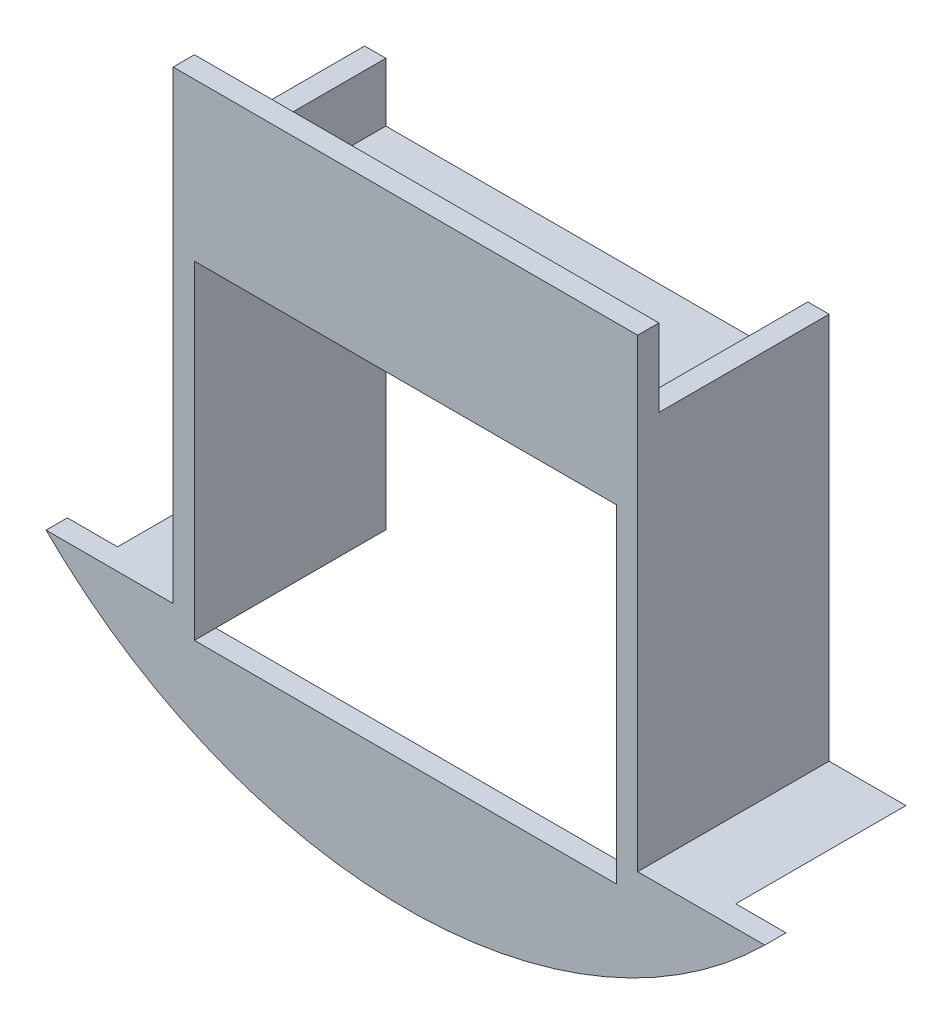
ISO-10303-21;
HEADER;
FILE_DESCRIPTION(('STEP AP214'),'2;1');
FILE_NAME('part.step','',(''),(''),'','','');
FILE_SCHEMA(('AUTOMOTIVE_DESIGN { 1 0 10303 214 1 1 1 1 }'));
ENDSEC;
DATA;
#1=APPLICATION_CONTEXT('core data for automotive mechanical design processes');
#2=APPLICATION_PROTOCOL_DEFINITION('international standard','automotive_design',2000,#1);
#3=PRODUCT_CONTEXT('',#1,'mechanical');
#4=PRODUCT('Part','Part','',(#3));
#5=PRODUCT_RELATED_PRODUCT_CATEGORY('part','',(#4));
#6=PRODUCT_DEFINITION_FORMATION('','',#4);
#7=PRODUCT_DEFINITION_CONTEXT('part definition',#1,'design');
#8=PRODUCT_DEFINITION('design','',#6,#7);
#9=PRODUCT_DEFINITION_SHAPE('','',#8);
#10=(LENGTH_UNIT() NAMED_UNIT(*) SI_UNIT(.MILLI.,.METRE.));
#11=(NAMED_UNIT(*) PLANE_ANGLE_UNIT() SI_UNIT($,.RADIAN.));
#12=(NAMED_UNIT(*) SI_UNIT($,.STERADIAN.) SOLID_ANGLE_UNIT());
#13=UNCERTAINTY_MEASURE_WITH_UNIT(LENGTH_MEASURE(1.E-05),#10,'distance_accuracy_value','');
#14=(GEOMETRIC_REPRESENTATION_CONTEXT(3) GLOBAL_UNCERTAINTY_ASSIGNED_CONTEXT((#13)) GLOBAL_UNIT_ASSIGNED_CONTEXT((#10,
#11,#12)) REPRESENTATION_CONTEXT('',''));
#15=CARTESIAN_POINT('',(0.,0.,0.));
#16=DIRECTION('',(0.,0.,1.));
#17=DIRECTION('',(1.,0.,0.));
#18=AXIS2_PLACEMENT_3D('',#15,#16,#17);
#19=CARTESIAN_POINT('',(34.671,-49.022,25.4));
#20=DIRECTION('',(-1.,0.,0.));
#21=DIRECTION('',(0.,-1.,0.));
#22=AXIS2_PLACEMENT_3D('',#19,#20,#21);
#23=PLANE('',#22);
#24=DIRECTION('',(0.,0.,1.));
#25=VECTOR('',#24,1.);
#26=CARTESIAN_POINT('',(34.671,-45.847,-11.9054431885964));
#27=LINE('',#26,#25);
#28=CARTESIAN_POINT('',(34.671,-45.847,0.));
#29=VERTEX_POINT('',#28);
#30=CARTESIAN_POINT('',(34.671,-45.847,28.575));
#31=VERTEX_POINT('',#30);
#32=EDGE_CURVE('E58',#29,#31,#27,.T.);
#33=ORIENTED_EDGE('',*,*,#32,.F.);
#34=DIRECTION('',(0.,1.,0.));
#35=VECTOR('',#34,1.);
#36=CARTESIAN_POINT('',(34.671,-49.022,0.));
#37=LINE('',#36,#35);
#38=CARTESIAN_POINT('',(34.671,11.938,0.));
#39=VERTEX_POINT('',#38);
#40=EDGE_CURVE('E190',#29,#39,#37,.T.);
#41=ORIENTED_EDGE('',*,*,#40,.T.);
#42=DIRECTION('',(0.,0.,-1.));
#43=VECTOR('',#42,1.);
#44=CARTESIAN_POINT('',(34.671,11.938,25.4));
#45=LINE('',#44,#43);
#46=CARTESIAN_POINT('',(34.671,11.938,25.4));
#47=VERTEX_POINT('',#46);
#48=EDGE_CURVE('E215',#47,#39,#45,.T.);
#49=ORIENTED_EDGE('',*,*,#48,.F.);
#50=DIRECTION('',(0.,1.,0.));
#51=VECTOR('',#50,1.);
#52=CARTESIAN_POINT('',(34.671,-45.847,25.4));
#53=LINE('',#52,#51);
#54=CARTESIAN_POINT('',(34.671,23.5101704078315,25.4));
#55=VERTEX_POINT('',#54);
#56=EDGE_CURVE('E333',#47,#55,#53,.T.);
#57=ORIENTED_EDGE('',*,*,#56,.T.);
#58=DIRECTION('',(0.,0.,-1.));
#59=VECTOR('',#58,1.);
#60=CARTESIAN_POINT('',(34.671,23.5101704078315,28.575));
#61=LINE('',#60,#59);
#62=CARTESIAN_POINT('',(34.671,23.5101704078315,28.575));
#63=VERTEX_POINT('',#62);
#64=EDGE_CURVE('E347',#63,#55,#61,.T.);
#65=ORIENTED_EDGE('',*,*,#64,.F.);
#66=DIRECTION('',(0.,1.,0.));
#67=VECTOR('',#66,1.);
#68=CARTESIAN_POINT('',(34.671,-45.847,28.575));
#69=LINE('',#68,#67);
#70=EDGE_CURVE('E309',#31,#63,#69,.T.);
#71=ORIENTED_EDGE('',*,*,#70,.F.);
#72=EDGE_LOOP('',(#33,#41,#49,#57,#65,#71));
#73=FACE_BOUND('',#72,.T.);
#74=ADVANCED_FACE('F42',(#73),#23,.F.);
#75=CARTESIAN_POINT('',(-34.671,11.938,25.4));
#76=DIRECTION('',(1.,0.,0.));
#77=DIRECTION('',(0.,1.,0.));
#78=AXIS2_PLACEMENT_3D('',#75,#76,#77);
#79=PLANE('',#78);
#80=DIRECTION('',(0.,-1.,0.));
#81=VECTOR('',#80,1.);
#82=CARTESIAN_POINT('',(-34.671,11.938,0.));
#83=LINE('',#82,#81);
#84=CARTESIAN_POINT('',(-34.671,11.938,0.));
#85=VERTEX_POINT('',#84);
#86=CARTESIAN_POINT('',(-34.671,-45.847,0.));
#87=VERTEX_POINT('',#86);
#88=EDGE_CURVE('E169',#85,#87,#83,.T.);
#89=ORIENTED_EDGE('',*,*,#88,.T.);
#90=DIRECTION('',(0.,0.,1.));
#91=VECTOR('',#90,1.);
#92=CARTESIAN_POINT('',(-34.671,-45.847,-11.9054431885964));
#93=LINE('',#92,#91);
#94=CARTESIAN_POINT('',(-34.671,-45.847,28.575));
#95=VERTEX_POINT('',#94);
#96=EDGE_CURVE('E385',#87,#95,#93,.T.);
#97=ORIENTED_EDGE('',*,*,#96,.T.);
#98=DIRECTION('',(0.,-1.,0.));
#99=VECTOR('',#98,1.);
#100=CARTESIAN_POINT('',(-34.671,-45.847,28.575));
#101=LINE('',#100,#99);
#102=CARTESIAN_POINT('',(-34.671,23.5101704078315,28.575));
#103=VERTEX_POINT('',#102);
#104=EDGE_CURVE('E317',#103,#95,#101,.T.);
#105=ORIENTED_EDGE('',*,*,#104,.F.);
#106=DIRECTION('',(0.,0.,-1.));
#107=VECTOR('',#106,1.);
#108=CARTESIAN_POINT('',(-34.671,23.5101704078315,28.575));
#109=LINE('',#108,#107);
#110=CARTESIAN_POINT('',(-34.671,23.5101704078315,25.4));
#111=VERTEX_POINT('',#110);
#112=EDGE_CURVE('E321',#103,#111,#109,.T.);
#113=ORIENTED_EDGE('',*,*,#112,.T.);
#114=DIRECTION('',(0.,-1.,0.));
#115=VECTOR('',#114,1.);
#116=CARTESIAN_POINT('',(-34.671,-45.847,25.4));
#117=LINE('',#116,#115);
#118=CARTESIAN_POINT('',(-34.671,11.938,25.4));
#119=VERTEX_POINT('',#118);
#120=EDGE_CURVE('E301',#111,#119,#117,.T.);
#121=ORIENTED_EDGE('',*,*,#120,.T.);
#122=DIRECTION('',(0.,0.,-1.));
#123=VECTOR('',#122,1.);
#124=CARTESIAN_POINT('',(-34.671,11.938,25.4));
#125=LINE('',#124,#123);
#126=EDGE_CURVE('E168',#119,#85,#125,.T.);
#127=ORIENTED_EDGE('',*,*,#126,.T.);
#128=EDGE_LOOP('',(#89,#97,#105,#113,#121,#127));
#129=FACE_BOUND('',#128,.T.);
#130=ADVANCED_FACE('F44',(#129),#79,.F.);
#131=CARTESIAN_POINT('',(-34.671,-49.022,25.4));
#132=DIRECTION('',(0.,1.,0.));
#133=DIRECTION('',(0.,0.,1.));
#134=AXIS2_PLACEMENT_3D('',#131,#132,#133);
#135=PLANE('',#134);
#136=DIRECTION('',(1.,0.,0.));
#137=VECTOR('',#136,1.);
#138=CARTESIAN_POINT('',(-34.671,-49.022,0.));
#139=LINE('',#138,#137);
#140=CARTESIAN_POINT('',(-42.1386,-49.022,0.));
#141=VERTEX_POINT('',#140);
#142=CARTESIAN_POINT('',(-31.496,-49.022,0.));
#143=VERTEX_POINT('',#142);
#144=EDGE_CURVE('E173',#141,#143,#139,.T.);
#145=ORIENTED_EDGE('',*,*,#144,.T.);
#146=DIRECTION('',(0.,0.,-1.));
#147=VECTOR('',#146,1.);
#148=CARTESIAN_POINT('',(-31.496,-49.022,25.4));
#149=LINE('',#148,#147);
#150=CARTESIAN_POINT('',(-31.496,-49.022,25.4));
#151=VERTEX_POINT('',#150);
#152=EDGE_CURVE('E11',#151,#143,#149,.T.);
#153=ORIENTED_EDGE('',*,*,#152,.F.);
#154=DIRECTION('',(1.,0.,0.));
#155=VECTOR('',#154,1.);
#156=CARTESIAN_POINT('',(-34.671,-49.022,25.4));
#157=LINE('',#156,#155);
#158=CARTESIAN_POINT('',(-42.1386,-49.022,25.4));
#159=VERTEX_POINT('',#158);
#160=EDGE_CURVE('E206',#159,#151,#157,.T.);
#161=ORIENTED_EDGE('',*,*,#160,.F.);
#162=DIRECTION('',(0.,0.,1.));
#163=VECTOR('',#162,1.);
#164=CARTESIAN_POINT('',(-42.1386,-49.022,-11.9054431885964));
#165=LINE('',#164,#163);
#166=EDGE_CURVE('E382',#141,#159,#165,.T.);
#167=ORIENTED_EDGE('',*,*,#166,.F.);
#168=EDGE_LOOP('',(#145,#153,#161,#167));
#169=FACE_BOUND('',#168,.T.);
#170=ADVANCED_FACE('F458',(#169),#135,.F.);
#171=CARTESIAN_POINT('',(-31.496,-49.022,25.4));
#172=DIRECTION('',(-1.,0.,0.));
#173=DIRECTION('',(0.,-1.,0.));
#174=AXIS2_PLACEMENT_3D('',#171,#172,#173);
#175=PLANE('',#174);
#176=DIRECTION('',(0.,1.,0.));
#177=VECTOR('',#176,1.);
#178=CARTESIAN_POINT('',(-31.496,-49.022,0.));
#179=LINE('',#178,#177);
#180=CARTESIAN_POINT('',(-31.496,0.,0.));
#181=VERTEX_POINT('',#180);
#182=EDGE_CURVE('E177',#143,#181,#179,.T.);
#183=ORIENTED_EDGE('',*,*,#182,.T.);
#184=DIRECTION('',(0.,0.,-1.));
#185=VECTOR('',#184,1.);
#186=CARTESIAN_POINT('',(-31.496,0.,25.4));
#187=LINE('',#186,#185);
#188=CARTESIAN_POINT('',(-31.496,0.,28.575));
#189=VERTEX_POINT('',#188);
#190=EDGE_CURVE('E51',#189,#181,#187,.T.);
#191=ORIENTED_EDGE('',*,*,#190,.F.);
#192=DIRECTION('',(0.,-1.,0.));
#193=VECTOR('',#192,1.);
#194=CARTESIAN_POINT('',(-31.496,0.,28.575));
#195=LINE('',#194,#193);
#196=CARTESIAN_POINT('',(-31.496,-49.022,28.575));
#197=VERTEX_POINT('',#196);
#198=EDGE_CURVE('E286',#189,#197,#195,.T.);
#199=ORIENTED_EDGE('',*,*,#198,.T.);
#200=DIRECTION('',(0.,0.,-1.));
#201=VECTOR('',#200,1.);
#202=CARTESIAN_POINT('',(-31.496,-49.022,28.575));
#203=LINE('',#202,#201);
#204=EDGE_CURVE('E280',#197,#151,#203,.T.);
#205=ORIENTED_EDGE('',*,*,#204,.T.);
#206=ORIENTED_EDGE('',*,*,#152,.T.);
#207=EDGE_LOOP('',(#183,#191,#199,#205,#206));
#208=FACE_BOUND('',#207,.T.);
#209=ADVANCED_FACE('F414',(#208),#175,.F.);
#210=CARTESIAN_POINT('',(-31.496,0.,25.4));
#211=DIRECTION('',(0.,1.,0.));
#212=DIRECTION('',(0.,0.,1.));
#213=AXIS2_PLACEMENT_3D('',#210,#211,#212);
#214=PLANE('',#213);
#215=DIRECTION('',(1.,0.,0.));
#216=VECTOR('',#215,1.);
#217=CARTESIAN_POINT('',(-31.496,0.,0.));
#218=LINE('',#217,#216);
#219=CARTESIAN_POINT('',(31.496,0.,0.));
#220=VERTEX_POINT('',#219);
#221=EDGE_CURVE('E180',#181,#220,#218,.T.);
#222=ORIENTED_EDGE('',*,*,#221,.T.);
#223=DIRECTION('',(0.,0.,-1.));
#224=VECTOR('',#223,1.);
#225=CARTESIAN_POINT('',(31.496,0.,25.4));
#226=LINE('',#225,#224);
#227=CARTESIAN_POINT('',(31.496,0.,28.575));
#228=VERTEX_POINT('',#227);
#229=EDGE_CURVE('E223',#228,#220,#226,.T.);
#230=ORIENTED_EDGE('',*,*,#229,.F.);
#231=DIRECTION('',(-1.,0.,0.));
#232=VECTOR('',#231,1.);
#233=CARTESIAN_POINT('',(-31.496,0.,28.575));
#234=LINE('',#233,#232);
#235=EDGE_CURVE('E236',#228,#189,#234,.T.);
#236=ORIENTED_EDGE('',*,*,#235,.T.);
#237=ORIENTED_EDGE('',*,*,#190,.T.);
#238=EDGE_LOOP('',(#222,#230,#236,#237));
#239=FACE_BOUND('',#238,.T.);
#240=ADVANCED_FACE('F232',(#239),#214,.F.);
#241=CARTESIAN_POINT('',(31.496,0.,25.4));
#242=DIRECTION('',(1.,0.,0.));
#243=DIRECTION('',(0.,1.,0.));
#244=AXIS2_PLACEMENT_3D('',#241,#242,#243);
#245=PLANE('',#244);
#246=DIRECTION('',(0.,-1.,0.));
#247=VECTOR('',#246,1.);
#248=CARTESIAN_POINT('',(31.496,0.,0.));
#249=LINE('',#248,#247);
#250=CARTESIAN_POINT('',(31.496,-49.022,0.));
#251=VERTEX_POINT('',#250);
#252=EDGE_CURVE('E183',#220,#251,#249,.T.);
#253=ORIENTED_EDGE('',*,*,#252,.T.);
#254=DIRECTION('',(0.,0.,-1.));
#255=VECTOR('',#254,1.);
#256=CARTESIAN_POINT('',(31.496,-49.022,25.4));
#257=LINE('',#256,#255);
#258=CARTESIAN_POINT('',(31.496,-49.022,25.4));
#259=VERTEX_POINT('',#258);
#260=EDGE_CURVE('E219',#259,#251,#257,.T.);
#261=ORIENTED_EDGE('',*,*,#260,.F.);
#262=DIRECTION('',(0.,0.,-1.));
#263=VECTOR('',#262,1.);
#264=CARTESIAN_POINT('',(31.496,-49.022,28.575));
#265=LINE('',#264,#263);
#266=CARTESIAN_POINT('',(31.496,-49.022,28.575));
#267=VERTEX_POINT('',#266);
#268=EDGE_CURVE('E270',#267,#259,#265,.T.);
#269=ORIENTED_EDGE('',*,*,#268,.F.);
#270=DIRECTION('',(0.,1.,0.));
#271=VECTOR('',#270,1.);
#272=CARTESIAN_POINT('',(31.496,0.,28.575));
#273=LINE('',#272,#271);
#274=EDGE_CURVE('E402',#267,#228,#273,.T.);
#275=ORIENTED_EDGE('',*,*,#274,.T.);
#276=ORIENTED_EDGE('',*,*,#229,.T.);
#277=EDGE_LOOP('',(#253,#261,#269,#275,#276));
#278=FACE_BOUND('',#277,.T.);
#279=ADVANCED_FACE('F249',(#278),#245,.F.);
#280=CARTESIAN_POINT('',(31.496,-49.022,25.4));
#281=DIRECTION('',(0.,1.,0.));
#282=DIRECTION('',(0.,0.,1.));
#283=AXIS2_PLACEMENT_3D('',#280,#281,#282);
#284=PLANE('',#283);
#285=DIRECTION('',(1.,0.,0.));
#286=VECTOR('',#285,1.);
#287=CARTESIAN_POINT('',(31.496,-49.022,0.));
#288=LINE('',#287,#286);
#289=CARTESIAN_POINT('',(42.1386,-49.022,0.));
#290=VERTEX_POINT('',#289);
#291=EDGE_CURVE('E186',#251,#290,#288,.T.);
#292=ORIENTED_EDGE('',*,*,#291,.T.);
#293=DIRECTION('',(0.,0.,1.));
#294=VECTOR('',#293,1.);
#295=CARTESIAN_POINT('',(42.1386,-49.022,-11.9054431885964));
#296=LINE('',#295,#294);
#297=CARTESIAN_POINT('',(42.1386,-49.022,25.4));
#298=VERTEX_POINT('',#297);
#299=EDGE_CURVE('E261',#290,#298,#296,.T.);
#300=ORIENTED_EDGE('',*,*,#299,.T.);
#301=DIRECTION('',(1.,0.,0.));
#302=VECTOR('',#301,1.);
#303=CARTESIAN_POINT('',(31.496,-49.022,25.4));
#304=LINE('',#303,#302);
#305=EDGE_CURVE('E158',#259,#298,#304,.T.);
#306=ORIENTED_EDGE('',*,*,#305,.F.);
#307=ORIENTED_EDGE('',*,*,#260,.T.);
#308=EDGE_LOOP('',(#292,#300,#306,#307));
#309=FACE_BOUND('',#308,.T.);
#310=ADVANCED_FACE('F254',(#309),#284,.F.);
#311=CARTESIAN_POINT('',(34.671,11.938,25.4));
#312=DIRECTION('',(0.,-1.,0.));
#313=DIRECTION('',(0.,0.,-1.));
#314=AXIS2_PLACEMENT_3D('',#311,#312,#313);
#315=PLANE('',#314);
#316=DIRECTION('',(-1.,0.,0.));
#317=VECTOR('',#316,1.);
#318=CARTESIAN_POINT('',(34.671,11.938,0.));
#319=LINE('',#318,#317);
#320=CARTESIAN_POINT('',(31.496,11.938,0.));
#321=VERTEX_POINT('',#320);
#322=EDGE_CURVE('E193',#39,#321,#319,.T.);
#323=ORIENTED_EDGE('',*,*,#322,.T.);
#324=DIRECTION('',(0.,0.,-1.));
#325=VECTOR('',#324,1.);
#326=CARTESIAN_POINT('',(31.496,11.938,25.4));
#327=LINE('',#326,#325);
#328=CARTESIAN_POINT('',(31.496,11.938,25.4));
#329=VERTEX_POINT('',#328);
#330=EDGE_CURVE('E139',#329,#321,#327,.T.);
#331=ORIENTED_EDGE('',*,*,#330,.F.);
#332=DIRECTION('',(-1.,0.,0.));
#333=VECTOR('',#332,1.);
#334=CARTESIAN_POINT('',(34.671,11.938,25.4));
#335=LINE('',#334,#333);
#336=EDGE_CURVE('E154',#47,#329,#335,.T.);
#337=ORIENTED_EDGE('',*,*,#336,.F.);
#338=ORIENTED_EDGE('',*,*,#48,.T.);
#339=EDGE_LOOP('',(#323,#331,#337,#338));
#340=FACE_BOUND('',#339,.T.);
#341=ADVANCED_FACE('F472',(#340),#315,.F.);
#342=CARTESIAN_POINT('',(31.496,11.938,25.4));
#343=DIRECTION('',(1.,0.,0.));
#344=DIRECTION('',(0.,0.,-1.));
#345=AXIS2_PLACEMENT_3D('',#342,#343,#344);
#346=PLANE('',#345);
#347=DIRECTION('',(0.,-1.,0.));
#348=VECTOR('',#347,1.);
#349=CARTESIAN_POINT('',(31.496,11.938,0.));
#350=LINE('',#349,#348);
#351=CARTESIAN_POINT('',(31.496,3.175,0.));
#352=VERTEX_POINT('',#351);
#353=EDGE_CURVE('E135',#321,#352,#350,.T.);
#354=ORIENTED_EDGE('',*,*,#353,.T.);
#355=DIRECTION('',(0.,0.,-1.));
#356=VECTOR('',#355,1.);
#357=CARTESIAN_POINT('',(31.496,3.175,25.4));
#358=LINE('',#357,#356);
#359=CARTESIAN_POINT('',(31.496,3.175,25.4));
#360=VERTEX_POINT('',#359);
#361=EDGE_CURVE('E127',#360,#352,#358,.T.);
#362=ORIENTED_EDGE('',*,*,#361,.F.);
#363=DIRECTION('',(0.,-1.,0.));
#364=VECTOR('',#363,1.);
#365=CARTESIAN_POINT('',(31.496,11.938,25.4));
#366=LINE('',#365,#364);
#367=EDGE_CURVE('E132',#329,#360,#366,.T.);
#368=ORIENTED_EDGE('',*,*,#367,.F.);
#369=ORIENTED_EDGE('',*,*,#330,.T.);
#370=EDGE_LOOP('',(#354,#362,#368,#369));
#371=FACE_BOUND('',#370,.T.);
#372=ADVANCED_FACE('F129',(#371),#346,.F.);
#373=CARTESIAN_POINT('',(31.496,3.175,25.4));
#374=DIRECTION('',(0.,-1.,0.));
#375=DIRECTION('',(0.,0.,-1.));
#376=AXIS2_PLACEMENT_3D('',#373,#374,#375);
#377=PLANE('',#376);
#378=DIRECTION('',(-1.,0.,0.));
#379=VECTOR('',#378,1.);
#380=CARTESIAN_POINT('',(31.496,3.175,0.));
#381=LINE('',#380,#379);
#382=CARTESIAN_POINT('',(-31.496,3.175,0.));
#383=VERTEX_POINT('',#382);
#384=EDGE_CURVE('E198',#352,#383,#381,.T.);
#385=ORIENTED_EDGE('',*,*,#384,.T.);
#386=DIRECTION('',(0.,0.,-1.));
#387=VECTOR('',#386,1.);
#388=CARTESIAN_POINT('',(-31.496,3.175,25.4));
#389=LINE('',#388,#387);
#390=CARTESIAN_POINT('',(-31.496,3.175,25.4));
#391=VERTEX_POINT('',#390);
#392=EDGE_CURVE('E140',#391,#383,#389,.T.);
#393=ORIENTED_EDGE('',*,*,#392,.F.);
#394=DIRECTION('',(-1.,0.,0.));
#395=VECTOR('',#394,1.);
#396=CARTESIAN_POINT('',(31.496,3.175,25.4));
#397=LINE('',#396,#395);
#398=EDGE_CURVE('E143',#360,#391,#397,.T.);
#399=ORIENTED_EDGE('',*,*,#398,.F.);
#400=ORIENTED_EDGE('',*,*,#361,.T.);
#401=EDGE_LOOP('',(#385,#393,#399,#400));
#402=FACE_BOUND('',#401,.T.);
#403=ADVANCED_FACE('F144',(#402),#377,.F.);
#404=CARTESIAN_POINT('',(-31.496,3.175,25.4));
#405=DIRECTION('',(-1.,0.,0.));
#406=DIRECTION('',(0.,0.,1.));
#407=AXIS2_PLACEMENT_3D('',#404,#405,#406);
#408=PLANE('',#407);
#409=DIRECTION('',(0.,1.,0.));
#410=VECTOR('',#409,1.);
#411=CARTESIAN_POINT('',(-31.496,3.175,0.));
#412=LINE('',#411,#410);
#413=CARTESIAN_POINT('',(-31.496,11.938,0.));
#414=VERTEX_POINT('',#413);
#415=EDGE_CURVE('E201',#383,#414,#412,.T.);
#416=ORIENTED_EDGE('',*,*,#415,.T.);
#417=DIRECTION('',(0.,0.,-1.));
#418=VECTOR('',#417,1.);
#419=CARTESIAN_POINT('',(-31.496,11.938,25.4));
#420=LINE('',#419,#418);
#421=CARTESIAN_POINT('',(-31.496,11.938,25.4));
#422=VERTEX_POINT('',#421);
#423=EDGE_CURVE('E67',#422,#414,#420,.T.);
#424=ORIENTED_EDGE('',*,*,#423,.F.);
#425=DIRECTION('',(0.,1.,0.));
#426=VECTOR('',#425,1.);
#427=CARTESIAN_POINT('',(-31.496,3.175,25.4));
#428=LINE('',#427,#426);
#429=EDGE_CURVE('E149',#391,#422,#428,.T.);
#430=ORIENTED_EDGE('',*,*,#429,.F.);
#431=ORIENTED_EDGE('',*,*,#392,.T.);
#432=EDGE_LOOP('',(#416,#424,#430,#431));
#433=FACE_BOUND('',#432,.T.);
#434=ADVANCED_FACE('F508',(#433),#408,.F.);
#435=CARTESIAN_POINT('',(-31.496,11.938,25.4));
#436=DIRECTION('',(0.,-1.,0.));
#437=DIRECTION('',(0.,0.,-1.));
#438=AXIS2_PLACEMENT_3D('',#435,#436,#437);
#439=PLANE('',#438);
#440=DIRECTION('',(-1.,0.,0.));
#441=VECTOR('',#440,1.);
#442=CARTESIAN_POINT('',(-31.496,11.938,0.));
#443=LINE('',#442,#441);
#444=EDGE_CURVE('E105',#414,#85,#443,.T.);
#445=ORIENTED_EDGE('',*,*,#444,.T.);
#446=ORIENTED_EDGE('',*,*,#126,.F.);
#447=DIRECTION('',(-1.,0.,0.));
#448=VECTOR('',#447,1.);
#449=CARTESIAN_POINT('',(-31.496,11.938,25.4));
#450=LINE('',#449,#448);
#451=EDGE_CURVE('E164',#422,#119,#450,.T.);
#452=ORIENTED_EDGE('',*,*,#451,.F.);
#453=ORIENTED_EDGE('',*,*,#423,.T.);
#454=EDGE_LOOP('',(#445,#446,#452,#453));
#455=FACE_BOUND('',#454,.T.);
#456=ADVANCED_FACE('F515',(#455),#439,.F.);
#457=CARTESIAN_POINT('',(0.,0.,0.));
#458=DIRECTION('',(0.,0.,1.));
#459=DIRECTION('',(1.,0.,0.));
#460=AXIS2_PLACEMENT_3D('',#457,#458,#459);
#461=PLANE('',#460);
#462=ORIENTED_EDGE('',*,*,#88,.F.);
#463=ORIENTED_EDGE('',*,*,#444,.F.);
#464=ORIENTED_EDGE('',*,*,#415,.F.);
#465=ORIENTED_EDGE('',*,*,#384,.F.);
#466=ORIENTED_EDGE('',*,*,#353,.F.);
#467=ORIENTED_EDGE('',*,*,#322,.F.);
#468=ORIENTED_EDGE('',*,*,#40,.F.);
#469=DIRECTION('',(1.,0.,0.));
#470=VECTOR('',#469,1.);
#471=CARTESIAN_POINT('',(46.1452735071505,-45.847,0.));
#472=LINE('',#471,#470);
#473=CARTESIAN_POINT('',(46.1452735071505,-45.847,0.));
#474=VERTEX_POINT('',#473);
#475=EDGE_CURVE('E359',#29,#474,#472,.T.);
#476=ORIENTED_EDGE('',*,*,#475,.T.);
#477=CARTESIAN_POINT('',(0.,8.27017040783147,0.));
#478=DIRECTION('',(0.,0.,1.));
#479=DIRECTION('',(1.,0.,0.));
#480=AXIS2_PLACEMENT_3D('',#477,#478,#479);
#481=CIRCLE('',#480,71.12);
#482=EDGE_CURVE('E363',#474,#290,#481,.F.);
#483=ORIENTED_EDGE('',*,*,#482,.T.);
#484=ORIENTED_EDGE('',*,*,#291,.F.);
#485=ORIENTED_EDGE('',*,*,#252,.F.);
#486=ORIENTED_EDGE('',*,*,#221,.F.);
#487=ORIENTED_EDGE('',*,*,#182,.F.);
#488=ORIENTED_EDGE('',*,*,#144,.F.);
#489=CARTESIAN_POINT('',(0.,8.27017040783147,0.));
#490=DIRECTION('',(0.,0.,1.));
#491=DIRECTION('',(1.,0.,0.));
#492=AXIS2_PLACEMENT_3D('',#489,#490,#491);
#493=CIRCLE('',#492,71.12);
#494=CARTESIAN_POINT('',(-46.1452735071505,-45.847,0.));
#495=VERTEX_POINT('',#494);
#496=EDGE_CURVE('E378',#141,#495,#493,.F.);
#497=ORIENTED_EDGE('',*,*,#496,.T.);
#498=DIRECTION('',(1.,0.,0.));
#499=VECTOR('',#498,1.);
#500=CARTESIAN_POINT('',(-46.1452735071505,-45.847,0.));
#501=LINE('',#500,#499);
#502=EDGE_CURVE('E174',#495,#87,#501,.T.);
#503=ORIENTED_EDGE('',*,*,#502,.T.);
#504=EDGE_LOOP('',(#462,#463,#464,#465,#466,#467,#468,#476,#483,#484,#485,#486,#487,#488,#497,#503));
#505=FACE_BOUND('',#504,.T.);
#506=ADVANCED_FACE('F244',(#505),#461,.F.);
#507=CARTESIAN_POINT('',(0.,8.27017040783147,-11.9054431885964));
#508=DIRECTION('',(0.,0.,1.));
#509=DIRECTION('',(1.,0.,0.));
#510=AXIS2_PLACEMENT_3D('',#507,#508,#509);
#511=CYLINDRICAL_SURFACE('',#510,71.12);
#512=ORIENTED_EDGE('',*,*,#496,.F.);
#513=ORIENTED_EDGE('',*,*,#166,.T.);
#514=CARTESIAN_POINT('',(0.,8.27017040783147,25.4));
#515=DIRECTION('',(0.,0.,1.));
#516=DIRECTION('',(-1.,0.,0.));
#517=AXIS2_PLACEMENT_3D('',#514,#515,#516);
#518=CIRCLE('',#517,71.12);
#519=CARTESIAN_POINT('',(-46.1452735071505,-45.847,25.4));
#520=VERTEX_POINT('',#519);
#521=EDGE_CURVE('E375',#520,#159,#518,.T.);
#522=ORIENTED_EDGE('',*,*,#521,.F.);
#523=DIRECTION('',(0.,0.,1.));
#524=VECTOR('',#523,1.);
#525=CARTESIAN_POINT('',(-46.1452735071505,-45.847,-11.9054431885964));
#526=LINE('',#525,#524);
#527=EDGE_CURVE('E389',#495,#520,#526,.T.);
#528=ORIENTED_EDGE('',*,*,#527,.F.);
#529=EDGE_LOOP('',(#512,#513,#522,#528));
#530=FACE_BOUND('',#529,.T.);
#531=ADVANCED_FACE('F456',(#530),#511,.T.);
#532=CARTESIAN_POINT('',(-46.1452735071505,-45.847,-11.9054431885964));
#533=DIRECTION('',(0.,1.,0.));
#534=DIRECTION('',(-1.,0.,0.));
#535=AXIS2_PLACEMENT_3D('',#532,#533,#534);
#536=PLANE('',#535);
#537=ORIENTED_EDGE('',*,*,#502,.F.);
#538=ORIENTED_EDGE('',*,*,#527,.T.);
#539=DIRECTION('',(-1.,0.,0.));
#540=VECTOR('',#539,1.);
#541=CARTESIAN_POINT('',(-53.6448680401931,-45.847,25.4));
#542=LINE('',#541,#540);
#543=CARTESIAN_POINT('',(-53.6448680401931,-45.847,25.4));
#544=VERTEX_POINT('',#543);
#545=EDGE_CURVE('E295',#520,#544,#542,.T.);
#546=ORIENTED_EDGE('',*,*,#545,.T.);
#547=DIRECTION('',(0.,0.,-1.));
#548=VECTOR('',#547,1.);
#549=CARTESIAN_POINT('',(-53.6448680401931,-45.847,28.575));
#550=LINE('',#549,#548);
#551=CARTESIAN_POINT('',(-53.6448680401931,-45.847,28.575));
#552=VERTEX_POINT('',#551);
#553=EDGE_CURVE('E355',#552,#544,#550,.T.);
#554=ORIENTED_EDGE('',*,*,#553,.F.);
#555=DIRECTION('',(-1.,0.,0.));
#556=VECTOR('',#555,1.);
#557=CARTESIAN_POINT('',(-53.6448680401931,-45.847,28.575));
#558=LINE('',#557,#556);
#559=EDGE_CURVE('E296',#95,#552,#558,.T.);
#560=ORIENTED_EDGE('',*,*,#559,.F.);
#561=ORIENTED_EDGE('',*,*,#96,.F.);
#562=EDGE_LOOP('',(#537,#538,#546,#554,#560,#561));
#563=FACE_BOUND('',#562,.T.);
#564=ADVANCED_FACE('F534',(#563),#536,.T.);
#565=CARTESIAN_POINT('',(0.,8.27017040783147,-11.9054431885964));
#566=DIRECTION('',(0.,0.,1.));
#567=DIRECTION('',(1.,0.,0.));
#568=AXIS2_PLACEMENT_3D('',#565,#566,#567);
#569=CYLINDRICAL_SURFACE('',#568,71.12);
#570=ORIENTED_EDGE('',*,*,#482,.F.);
#571=DIRECTION('',(0.,0.,1.));
#572=VECTOR('',#571,1.);
#573=CARTESIAN_POINT('',(46.1452735071505,-45.847,-11.9054431885964));
#574=LINE('',#573,#572);
#575=CARTESIAN_POINT('',(46.1452735071505,-45.847,25.4));
#576=VERTEX_POINT('',#575);
#577=EDGE_CURVE('E364',#474,#576,#574,.T.);
#578=ORIENTED_EDGE('',*,*,#577,.T.);
#579=CARTESIAN_POINT('',(0.,8.27017040783147,25.4));
#580=DIRECTION('',(0.,0.,1.));
#581=DIRECTION('',(1.,0.,0.));
#582=AXIS2_PLACEMENT_3D('',#579,#580,#581);
#583=CIRCLE('',#582,71.12);
#584=EDGE_CURVE('E368',#298,#576,#583,.T.);
#585=ORIENTED_EDGE('',*,*,#584,.F.);
#586=ORIENTED_EDGE('',*,*,#299,.F.);
#587=EDGE_LOOP('',(#570,#578,#585,#586));
#588=FACE_BOUND('',#587,.T.);
#589=ADVANCED_FACE('F541',(#588),#569,.T.);
#590=CARTESIAN_POINT('',(46.1452735071505,-45.847,-11.9054431885964));
#591=DIRECTION('',(0.,1.,0.));
#592=DIRECTION('',(-1.,0.,0.));
#593=AXIS2_PLACEMENT_3D('',#590,#591,#592);
#594=PLANE('',#593);
#595=ORIENTED_EDGE('',*,*,#475,.F.);
#596=ORIENTED_EDGE('',*,*,#32,.T.);
#597=DIRECTION('',(-1.,0.,0.));
#598=VECTOR('',#597,1.);
#599=CARTESIAN_POINT('',(34.671,-45.847,28.575));
#600=LINE('',#599,#598);
#601=CARTESIAN_POINT('',(53.6448680401931,-45.847,28.575));
#602=VERTEX_POINT('',#601);
#603=EDGE_CURVE('E305',#602,#31,#600,.T.);
#604=ORIENTED_EDGE('',*,*,#603,.F.);
#605=DIRECTION('',(0.,0.,-1.));
#606=VECTOR('',#605,1.);
#607=CARTESIAN_POINT('',(53.6448680401931,-45.847,28.575));
#608=LINE('',#607,#606);
#609=CARTESIAN_POINT('',(53.6448680401931,-45.847,25.4));
#610=VERTEX_POINT('',#609);
#611=EDGE_CURVE('E351',#602,#610,#608,.T.);
#612=ORIENTED_EDGE('',*,*,#611,.T.);
#613=DIRECTION('',(-1.,0.,0.));
#614=VECTOR('',#613,1.);
#615=CARTESIAN_POINT('',(34.671,-45.847,25.4));
#616=LINE('',#615,#614);
#617=EDGE_CURVE('E329',#610,#576,#616,.T.);
#618=ORIENTED_EDGE('',*,*,#617,.T.);
#619=ORIENTED_EDGE('',*,*,#577,.F.);
#620=EDGE_LOOP('',(#595,#596,#604,#612,#618,#619));
#621=FACE_BOUND('',#620,.T.);
#622=ADVANCED_FACE('F549',(#621),#594,.T.);
#623=CARTESIAN_POINT('',(0.,8.27017040783147,25.4));
#624=DIRECTION('',(0.,0.,1.));
#625=DIRECTION('',(1.,0.,0.));
#626=AXIS2_PLACEMENT_3D('',#623,#624,#625);
#627=PLANE('',#626);
#628=ORIENTED_EDGE('',*,*,#545,.F.);
#629=ORIENTED_EDGE('',*,*,#521,.T.);
#630=ORIENTED_EDGE('',*,*,#160,.T.);
#631=DIRECTION('',(1.,0.,0.));
#632=VECTOR('',#631,1.);
#633=CARTESIAN_POINT('',(-31.496,-49.022,25.4));
#634=LINE('',#633,#632);
#635=EDGE_CURVE('E273',#151,#259,#634,.T.);
#636=ORIENTED_EDGE('',*,*,#635,.T.);
#637=ORIENTED_EDGE('',*,*,#305,.T.);
#638=ORIENTED_EDGE('',*,*,#584,.T.);
#639=ORIENTED_EDGE('',*,*,#617,.F.);
#640=CARTESIAN_POINT('',(0.,8.27017040783147,25.4));
#641=DIRECTION('',(0.,0.,1.));
#642=DIRECTION('',(1.,0.,0.));
#643=AXIS2_PLACEMENT_3D('',#640,#641,#642);
#644=CIRCLE('',#643,76.2);
#645=EDGE_CURVE('E325',#544,#610,#644,.T.);
#646=ORIENTED_EDGE('',*,*,#645,.F.);
#647=EDGE_LOOP('',(#628,#629,#630,#636,#637,#638,#639,#646));
#648=FACE_BOUND('',#647,.T.);
#649=ADVANCED_FACE('F283',(#648),#627,.F.);
#650=ORIENTED_EDGE('',*,*,#56,.F.);
#651=ORIENTED_EDGE('',*,*,#336,.T.);
#652=ORIENTED_EDGE('',*,*,#367,.T.);
#653=ORIENTED_EDGE('',*,*,#398,.T.);
#654=ORIENTED_EDGE('',*,*,#429,.T.);
#655=ORIENTED_EDGE('',*,*,#451,.T.);
#656=ORIENTED_EDGE('',*,*,#120,.F.);
#657=DIRECTION('',(-1.,0.,0.));
#658=VECTOR('',#657,1.);
#659=CARTESIAN_POINT('',(-34.671,23.5101704078315,25.4));
#660=LINE('',#659,#658);
#661=EDGE_CURVE('E337',#55,#111,#660,.T.);
#662=ORIENTED_EDGE('',*,*,#661,.F.);
#663=EDGE_LOOP('',(#650,#651,#652,#653,#654,#655,#656,#662));
#664=FACE_BOUND('',#663,.T.);
#665=ADVANCED_FACE('F152',(#664),#627,.F.);
#666=CARTESIAN_POINT('',(0.,8.27017040783147,28.575));
#667=DIRECTION('',(0.,0.,1.));
#668=DIRECTION('',(1.,0.,0.));
#669=AXIS2_PLACEMENT_3D('',#666,#667,#668);
#670=PLANE('',#669);
#671=ORIENTED_EDGE('',*,*,#559,.T.);
#672=CARTESIAN_POINT('',(0.,8.27017040783147,28.575));
#673=DIRECTION('',(0.,0.,1.));
#674=DIRECTION('',(1.,0.,0.));
#675=AXIS2_PLACEMENT_3D('',#672,#673,#674);
#676=CIRCLE('',#675,76.2);
#677=EDGE_CURVE('E300',#552,#602,#676,.T.);
#678=ORIENTED_EDGE('',*,*,#677,.T.);
#679=ORIENTED_EDGE('',*,*,#603,.T.);
#680=ORIENTED_EDGE('',*,*,#70,.T.);
#681=DIRECTION('',(-1.,0.,0.));
#682=VECTOR('',#681,1.);
#683=CARTESIAN_POINT('',(-34.671,23.5101704078315,28.575));
#684=LINE('',#683,#682);
#685=EDGE_CURVE('E313',#63,#103,#684,.T.);
#686=ORIENTED_EDGE('',*,*,#685,.T.);
#687=ORIENTED_EDGE('',*,*,#104,.T.);
#688=EDGE_LOOP('',(#671,#678,#679,#680,#686,#687));
#689=FACE_BOUND('',#688,.T.);
#690=DIRECTION('',(1.,0.,0.));
#691=VECTOR('',#690,1.);
#692=CARTESIAN_POINT('',(-31.496,-49.022,28.575));
#693=LINE('',#692,#691);
#694=EDGE_CURVE('E277',#197,#267,#693,.T.);
#695=ORIENTED_EDGE('',*,*,#694,.F.);
#696=ORIENTED_EDGE('',*,*,#198,.F.);
#697=ORIENTED_EDGE('',*,*,#235,.F.);
#698=ORIENTED_EDGE('',*,*,#274,.F.);
#699=EDGE_LOOP('',(#695,#696,#697,#698));
#700=FACE_BOUND('',#699,.T.);
#701=ADVANCED_FACE('F410',(#689,#700),#670,.T.);
#702=CARTESIAN_POINT('',(0.,8.27017040783147,28.575));
#703=DIRECTION('',(0.,0.,-1.));
#704=DIRECTION('',(-1.,0.,0.));
#705=AXIS2_PLACEMENT_3D('',#702,#703,#704);
#706=CYLINDRICAL_SURFACE('',#705,76.2);
#707=ORIENTED_EDGE('',*,*,#645,.T.);
#708=ORIENTED_EDGE('',*,*,#611,.F.);
#709=ORIENTED_EDGE('',*,*,#677,.F.);
#710=ORIENTED_EDGE('',*,*,#553,.T.);
#711=EDGE_LOOP('',(#707,#708,#709,#710));
#712=FACE_BOUND('',#711,.T.);
#713=ADVANCED_FACE('F575',(#712),#706,.T.);
#714=CARTESIAN_POINT('',(-34.671,23.5101704078315,28.575));
#715=DIRECTION('',(0.,-1.,0.));
#716=DIRECTION('',(0.,0.,-1.));
#717=AXIS2_PLACEMENT_3D('',#714,#715,#716);
#718=PLANE('',#717);
#719=ORIENTED_EDGE('',*,*,#661,.T.);
#720=ORIENTED_EDGE('',*,*,#112,.F.);
#721=ORIENTED_EDGE('',*,*,#685,.F.);
#722=ORIENTED_EDGE('',*,*,#64,.T.);
#723=EDGE_LOOP('',(#719,#720,#721,#722));
#724=FACE_BOUND('',#723,.T.);
#725=ADVANCED_FACE('F583',(#724),#718,.F.);
#726=CARTESIAN_POINT('',(-31.496,-49.022,28.575));
#727=DIRECTION('',(0.,1.,0.));
#728=DIRECTION('',(0.,0.,1.));
#729=AXIS2_PLACEMENT_3D('',#726,#727,#728);
#730=PLANE('',#729);
#731=ORIENTED_EDGE('',*,*,#635,.F.);
#732=ORIENTED_EDGE('',*,*,#204,.F.);
#733=ORIENTED_EDGE('',*,*,#694,.T.);
#734=ORIENTED_EDGE('',*,*,#268,.T.);
#735=EDGE_LOOP('',(#731,#732,#733,#734));
#736=FACE_BOUND('',#735,.T.);
#737=ADVANCED_FACE('F271',(#736),#730,.T.);
#738=CLOSED_SHELL('',(#74,#130,#170,#209,#240,#279,#310,#341,#372,#403,#434,#456,#506,#531,#564,
#589,#622,#649,#665,#701,#713,#725,#737));
#739=MANIFOLD_SOLID_BREP('B2',#738);
#740=ADVANCED_BREP_SHAPE_REPRESENTATION('',(#18,#739),#14);
#741=SHAPE_DEFINITION_REPRESENTATION(#9,#740);
ENDSEC;
END-ISO-10303-21;
